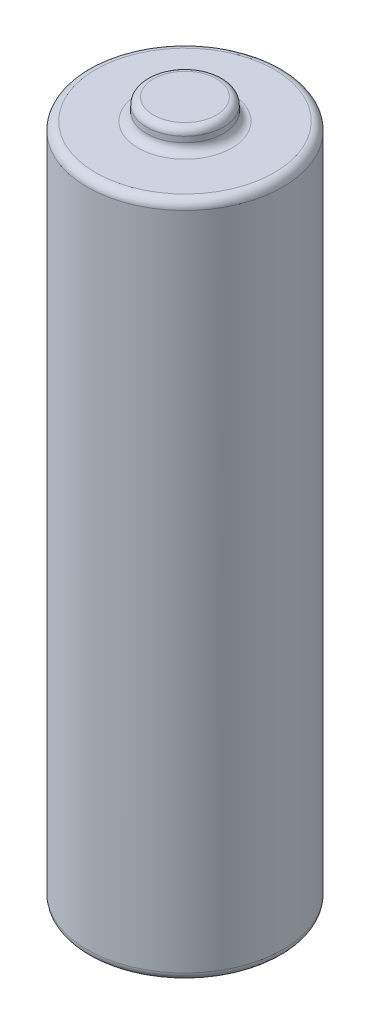
ISO-10303-21;
HEADER;
FILE_DESCRIPTION(('STEP AP214'),'2;1');
FILE_NAME('part.step','',(''),(''),'','','');
FILE_SCHEMA(('AUTOMOTIVE_DESIGN { 1 0 10303 214 1 1 1 1 }'));
ENDSEC;
DATA;
#1=APPLICATION_CONTEXT('core data for automotive mechanical design processes');
#2=APPLICATION_PROTOCOL_DEFINITION('international standard','automotive_design',2000,#1);
#3=PRODUCT_CONTEXT('',#1,'mechanical');
#4=PRODUCT('Part','Part','',(#3));
#5=PRODUCT_RELATED_PRODUCT_CATEGORY('part','',(#4));
#6=PRODUCT_DEFINITION_FORMATION('','',#4);
#7=PRODUCT_DEFINITION_CONTEXT('part definition',#1,'design');
#8=PRODUCT_DEFINITION('design','',#6,#7);
#9=PRODUCT_DEFINITION_SHAPE('','',#8);
#10=(LENGTH_UNIT() NAMED_UNIT(*) SI_UNIT(.MILLI.,.METRE.));
#11=(NAMED_UNIT(*) PLANE_ANGLE_UNIT() SI_UNIT($,.RADIAN.));
#12=(NAMED_UNIT(*) SI_UNIT($,.STERADIAN.) SOLID_ANGLE_UNIT());
#13=UNCERTAINTY_MEASURE_WITH_UNIT(LENGTH_MEASURE(1.E-05),#10,'distance_accuracy_value','');
#14=(GEOMETRIC_REPRESENTATION_CONTEXT(3) GLOBAL_UNCERTAINTY_ASSIGNED_CONTEXT((#13)) GLOBAL_UNIT_ASSIGNED_CONTEXT((#10,
#11,#12)) REPRESENTATION_CONTEXT('',''));
#15=CARTESIAN_POINT('',(0.,0.,0.));
#16=DIRECTION('',(0.,0.,1.));
#17=DIRECTION('',(1.,0.,0.));
#18=AXIS2_PLACEMENT_3D('',#15,#16,#17);
#19=CARTESIAN_POINT('',(0.,49.,0.));
#20=DIRECTION('',(0.,-1.,0.));
#21=DIRECTION('',(0.,0.,-1.));
#22=AXIS2_PLACEMENT_3D('',#19,#20,#21);
#23=CYLINDRICAL_SURFACE('',#22,7.);
#24=CARTESIAN_POINT('',(0.,48.4,0.));
#25=DIRECTION('',(0.,1.,0.));
#26=DIRECTION('',(0.,0.,1.));
#27=AXIS2_PLACEMENT_3D('',#24,#25,#26);
#28=CIRCLE('',#27,7.);
#29=CARTESIAN_POINT('',(0.,48.4,7.));
#30=VERTEX_POINT('',#29);
#31=EDGE_CURVE('E48',#30,#30,#28,.F.);
#32=ORIENTED_EDGE('',*,*,#31,.T.);
#33=EDGE_LOOP('',(#32));
#34=FACE_BOUND('',#33,.T.);
#35=CARTESIAN_POINT('',(0.,1.1,0.));
#36=DIRECTION('',(0.,-1.,0.));
#37=DIRECTION('',(0.,0.,-1.));
#38=AXIS2_PLACEMENT_3D('',#35,#36,#37);
#39=CIRCLE('',#38,7.);
#40=CARTESIAN_POINT('',(0.,1.1,-7.));
#41=VERTEX_POINT('',#40);
#42=EDGE_CURVE('E56',#41,#41,#39,.F.);
#43=ORIENTED_EDGE('',*,*,#42,.T.);
#44=EDGE_LOOP('',(#43));
#45=FACE_BOUND('',#44,.T.);
#46=ADVANCED_FACE('F33',(#34,#45),#23,.T.);
#47=CARTESIAN_POINT('',(0.,49.,0.));
#48=DIRECTION('',(0.,1.,0.));
#49=DIRECTION('',(0.,0.,1.));
#50=AXIS2_PLACEMENT_3D('',#47,#48,#49);
#51=PLANE('',#50);
#52=CARTESIAN_POINT('',(0.,49.,0.));
#53=DIRECTION('',(0.,1.,0.));
#54=DIRECTION('',(0.,0.,1.));
#55=AXIS2_PLACEMENT_3D('',#52,#53,#54);
#56=CIRCLE('',#55,6.4);
#57=CARTESIAN_POINT('',(0.,49.,6.4));
#58=VERTEX_POINT('',#57);
#59=EDGE_CURVE('E53',#58,#58,#56,.T.);
#60=ORIENTED_EDGE('',*,*,#59,.T.);
#61=EDGE_LOOP('',(#60));
#62=FACE_BOUND('',#61,.T.);
#63=CARTESIAN_POINT('',(0.,49.,0.));
#64=DIRECTION('',(0.,1.,0.));
#65=DIRECTION('',(0.,0.,1.));
#66=AXIS2_PLACEMENT_3D('',#63,#64,#65);
#67=CIRCLE('',#66,3.35);
#68=CARTESIAN_POINT('',(0.,49.,3.35));
#69=VERTEX_POINT('',#68);
#70=EDGE_CURVE('E68',#69,#69,#67,.F.);
#71=ORIENTED_EDGE('',*,*,#70,.T.);
#72=EDGE_LOOP('',(#71));
#73=FACE_BOUND('',#72,.T.);
#74=ADVANCED_FACE('F95',(#62,#73),#51,.T.);
#75=CARTESIAN_POINT('',(0.,50.5,0.));
#76=DIRECTION('',(0.,-1.,0.));
#77=DIRECTION('',(0.,0.,-1.));
#78=AXIS2_PLACEMENT_3D('',#75,#76,#77);
#79=CYLINDRICAL_SURFACE('',#78,2.75);
#80=CARTESIAN_POINT('',(0.,50.,0.));
#81=DIRECTION('',(0.,1.,0.));
#82=DIRECTION('',(0.,0.,1.));
#83=AXIS2_PLACEMENT_3D('',#80,#81,#82);
#84=CIRCLE('',#83,2.75);
#85=CARTESIAN_POINT('',(0.,50.,2.75));
#86=VERTEX_POINT('',#85);
#87=EDGE_CURVE('E62',#86,#86,#84,.F.);
#88=ORIENTED_EDGE('',*,*,#87,.T.);
#89=EDGE_LOOP('',(#88));
#90=FACE_BOUND('',#89,.T.);
#91=CARTESIAN_POINT('',(0.,49.6,0.));
#92=DIRECTION('',(0.,1.,0.));
#93=DIRECTION('',(0.,0.,1.));
#94=AXIS2_PLACEMENT_3D('',#91,#92,#93);
#95=CIRCLE('',#94,2.75);
#96=CARTESIAN_POINT('',(0.,49.6,2.75));
#97=VERTEX_POINT('',#96);
#98=EDGE_CURVE('E71',#97,#97,#95,.T.);
#99=ORIENTED_EDGE('',*,*,#98,.T.);
#100=EDGE_LOOP('',(#99));
#101=FACE_BOUND('',#100,.T.);
#102=ADVANCED_FACE('F75',(#90,#101),#79,.T.);
#103=CARTESIAN_POINT('',(0.,50.5,0.));
#104=DIRECTION('',(0.,1.,0.));
#105=DIRECTION('',(0.,0.,1.));
#106=AXIS2_PLACEMENT_3D('',#103,#104,#105);
#107=PLANE('',#106);
#108=CARTESIAN_POINT('',(0.,50.5,0.));
#109=DIRECTION('',(0.,1.,0.));
#110=DIRECTION('',(0.,0.,1.));
#111=AXIS2_PLACEMENT_3D('',#108,#109,#110);
#112=CIRCLE('',#111,2.25);
#113=CARTESIAN_POINT('',(0.,50.5,2.25));
#114=VERTEX_POINT('',#113);
#115=EDGE_CURVE('E65',#114,#114,#112,.T.);
#116=ORIENTED_EDGE('',*,*,#115,.T.);
#117=EDGE_LOOP('',(#116));
#118=FACE_BOUND('',#117,.T.);
#119=ADVANCED_FACE('F80',(#118),#107,.T.);
#120=CARTESIAN_POINT('',(0.,49.6,0.));
#121=DIRECTION('',(0.,1.,0.));
#122=DIRECTION('',(0.,0.,1.));
#123=AXIS2_PLACEMENT_3D('',#120,#121,#122);
#124=TOROIDAL_SURFACE('',#123,3.35,0.6);
#125=ORIENTED_EDGE('',*,*,#70,.F.);
#126=EDGE_LOOP('',(#125));
#127=FACE_BOUND('',#126,.T.);
#128=ORIENTED_EDGE('',*,*,#98,.F.);
#129=EDGE_LOOP('',(#128));
#130=FACE_BOUND('',#129,.T.);
#131=ADVANCED_FACE('F77',(#127,#130),#124,.F.);
#132=CARTESIAN_POINT('',(0.,50.,0.));
#133=DIRECTION('',(0.,1.,0.));
#134=DIRECTION('',(0.,0.,1.));
#135=AXIS2_PLACEMENT_3D('',#132,#133,#134);
#136=TOROIDAL_SURFACE('',#135,2.25,0.5);
#137=ORIENTED_EDGE('',*,*,#87,.F.);
#138=EDGE_LOOP('',(#137));
#139=FACE_BOUND('',#138,.T.);
#140=ORIENTED_EDGE('',*,*,#115,.F.);
#141=EDGE_LOOP('',(#140));
#142=FACE_BOUND('',#141,.T.);
#143=ADVANCED_FACE('F79',(#139,#142),#136,.T.);
#144=CARTESIAN_POINT('',(0.,0.5,0.));
#145=DIRECTION('',(0.,-1.,0.));
#146=DIRECTION('',(0.,0.,-1.));
#147=AXIS2_PLACEMENT_3D('',#144,#145,#146);
#148=PLANE('',#147);
#149=CARTESIAN_POINT('',(0.,0.5,0.));
#150=DIRECTION('',(0.,-1.,0.));
#151=DIRECTION('',(0.,0.,-1.));
#152=AXIS2_PLACEMENT_3D('',#149,#150,#151);
#153=CIRCLE('',#152,5.09160797830996);
#154=CARTESIAN_POINT('',(0.,0.5,-5.09160797830996));
#155=VERTEX_POINT('',#154);
#156=EDGE_CURVE('E10',#155,#155,#153,.F.);
#157=ORIENTED_EDGE('',*,*,#156,.T.);
#158=EDGE_LOOP('',(#157));
#159=FACE_BOUND('',#158,.T.);
#160=CARTESIAN_POINT('',(0.,0.5,0.));
#161=DIRECTION('',(0.,-1.,0.));
#162=DIRECTION('',(0.,0.,-1.));
#163=AXIS2_PLACEMENT_3D('',#160,#161,#162);
#164=CIRCLE('',#163,6.4);
#165=CARTESIAN_POINT('',(0.,0.5,-6.4));
#166=VERTEX_POINT('',#165);
#167=EDGE_CURVE('E59',#166,#166,#164,.T.);
#168=ORIENTED_EDGE('',*,*,#167,.T.);
#169=EDGE_LOOP('',(#168));
#170=FACE_BOUND('',#169,.T.);
#171=ADVANCED_FACE('F87',(#159,#170),#148,.T.);
#172=CARTESIAN_POINT('',(0.,0.,0.));
#173=DIRECTION('',(0.,1.,0.));
#174=DIRECTION('',(0.,0.,1.));
#175=AXIS2_PLACEMENT_3D('',#172,#173,#174);
#176=PLANE('',#175);
#177=CARTESIAN_POINT('',(0.,0.,0.));
#178=DIRECTION('',(0.,1.,0.));
#179=DIRECTION('',(0.,0.,1.));
#180=AXIS2_PLACEMENT_3D('',#177,#178,#179);
#181=CIRCLE('',#180,4.5);
#182=CARTESIAN_POINT('',(0.,0.,4.5));
#183=VERTEX_POINT('',#182);
#184=EDGE_CURVE('E44',#183,#183,#181,.F.);
#185=ORIENTED_EDGE('',*,*,#184,.T.);
#186=EDGE_LOOP('',(#185));
#187=FACE_BOUND('',#186,.T.);
#188=ADVANCED_FACE('F104',(#187),#176,.F.);
#189=CARTESIAN_POINT('',(0.,1.1,0.));
#190=DIRECTION('',(0.,-1.,0.));
#191=DIRECTION('',(0.,0.,-1.));
#192=AXIS2_PLACEMENT_3D('',#189,#190,#191);
#193=TOROIDAL_SURFACE('',#192,6.4,0.6);
#194=ORIENTED_EDGE('',*,*,#42,.F.);
#195=EDGE_LOOP('',(#194));
#196=FACE_BOUND('',#195,.T.);
#197=ORIENTED_EDGE('',*,*,#167,.F.);
#198=EDGE_LOOP('',(#197));
#199=FACE_BOUND('',#198,.T.);
#200=ADVANCED_FACE('F106',(#196,#199),#193,.T.);
#201=CARTESIAN_POINT('',(0.,48.4,0.));
#202=DIRECTION('',(0.,1.,0.));
#203=DIRECTION('',(0.,0.,1.));
#204=AXIS2_PLACEMENT_3D('',#201,#202,#203);
#205=TOROIDAL_SURFACE('',#204,6.4,0.6);
#206=ORIENTED_EDGE('',*,*,#31,.F.);
#207=EDGE_LOOP('',(#206));
#208=FACE_BOUND('',#207,.T.);
#209=ORIENTED_EDGE('',*,*,#59,.F.);
#210=EDGE_LOOP('',(#209));
#211=FACE_BOUND('',#210,.T.);
#212=ADVANCED_FACE('F120',(#208,#211),#205,.T.);
#213=CARTESIAN_POINT('',(0.,0.1,0.));
#214=DIRECTION('',(0.,1.,0.));
#215=DIRECTION('',(0.,0.,1.));
#216=AXIS2_PLACEMENT_3D('',#213,#214,#215);
#217=TOROIDAL_SURFACE('',#216,4.5,0.1);
#218=CARTESIAN_POINT('',(0.,0.0833333333333398,0.));
#219=DIRECTION('',(0.,1.,0.));
#220=DIRECTION('',(0.,0.,1.));
#221=AXIS2_PLACEMENT_3D('',#218,#219,#220);
#222=CIRCLE('',#221,4.59860132971829);
#223=CARTESIAN_POINT('',(0.,0.0833333333333398,4.59860132971829));
#224=VERTEX_POINT('',#223);
#225=EDGE_CURVE('E40',#224,#224,#222,.F.);
#226=ORIENTED_EDGE('',*,*,#225,.T.);
#227=EDGE_LOOP('',(#226));
#228=FACE_BOUND('',#227,.T.);
#229=ORIENTED_EDGE('',*,*,#184,.F.);
#230=EDGE_LOOP('',(#229));
#231=FACE_BOUND('',#230,.T.);
#232=ADVANCED_FACE('F127',(#228,#231),#217,.T.);
#233=CARTESIAN_POINT('',(0.,0.,0.));
#234=DIRECTION('',(0.,-1.,0.));
#235=DIRECTION('',(0.,0.,-1.));
#236=AXIS2_PLACEMENT_3D('',#233,#234,#235);
#237=TOROIDAL_SURFACE('',#236,5.09160797830996,0.5);
#238=ORIENTED_EDGE('',*,*,#156,.F.);
#239=EDGE_LOOP('',(#238));
#240=FACE_BOUND('',#239,.T.);
#241=ORIENTED_EDGE('',*,*,#225,.F.);
#242=EDGE_LOOP('',(#241));
#243=FACE_BOUND('',#242,.T.);
#244=ADVANCED_FACE('F35',(#240,#243),#237,.F.);
#245=CLOSED_SHELL('',(#46,#74,#102,#119,#131,#143,#171,#188,#200,#212,#232,#244));
#246=MANIFOLD_SOLID_BREP('B2',#245);
#247=ADVANCED_BREP_SHAPE_REPRESENTATION('',(#18,#246),#14);
#248=SHAPE_DEFINITION_REPRESENTATION(#9,#247);
ENDSEC;
END-ISO-10303-21;
